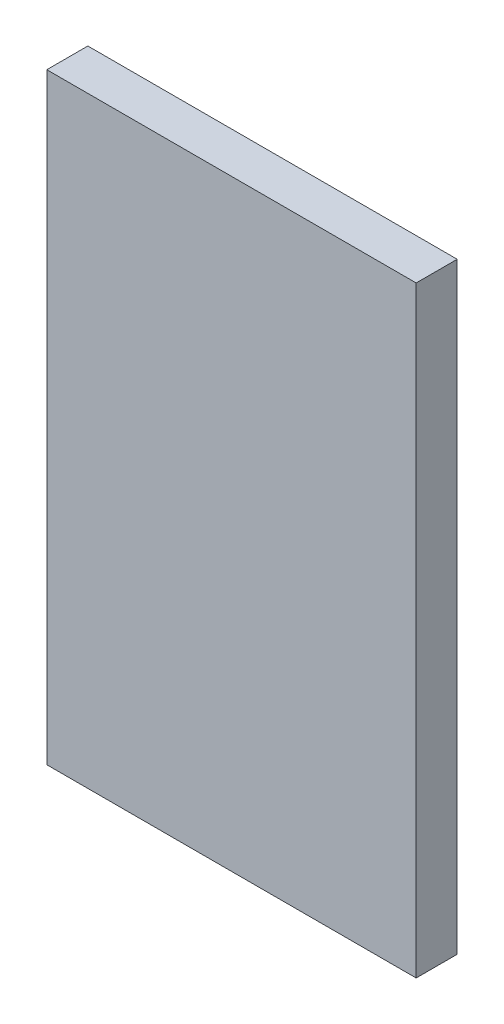
ISO-10303-21;
HEADER;
FILE_DESCRIPTION(('STEP AP214'),'2;1');
FILE_NAME('part.step','',(''),(''),'','','');
FILE_SCHEMA(('AUTOMOTIVE_DESIGN { 1 0 10303 214 1 1 1 1 }'));
ENDSEC;
DATA;
#1=APPLICATION_CONTEXT('core data for automotive mechanical design processes');
#2=APPLICATION_PROTOCOL_DEFINITION('international standard','automotive_design',2000,#1);
#3=PRODUCT_CONTEXT('',#1,'mechanical');
#4=PRODUCT('Part','Part','',(#3));
#5=PRODUCT_RELATED_PRODUCT_CATEGORY('part','',(#4));
#6=PRODUCT_DEFINITION_FORMATION('','',#4);
#7=PRODUCT_DEFINITION_CONTEXT('part definition',#1,'design');
#8=PRODUCT_DEFINITION('design','',#6,#7);
#9=PRODUCT_DEFINITION_SHAPE('','',#8);
#10=(LENGTH_UNIT() NAMED_UNIT(*) SI_UNIT(.MILLI.,.METRE.));
#11=(NAMED_UNIT(*) PLANE_ANGLE_UNIT() SI_UNIT($,.RADIAN.));
#12=(NAMED_UNIT(*) SI_UNIT($,.STERADIAN.) SOLID_ANGLE_UNIT());
#13=UNCERTAINTY_MEASURE_WITH_UNIT(LENGTH_MEASURE(1.E-05),#10,'distance_accuracy_value','');
#14=(GEOMETRIC_REPRESENTATION_CONTEXT(3) GLOBAL_UNCERTAINTY_ASSIGNED_CONTEXT((#13)) GLOBAL_UNIT_ASSIGNED_CONTEXT((#10,
#11,#12)) REPRESENTATION_CONTEXT('',''));
#15=CARTESIAN_POINT('',(0.,0.,0.));
#16=DIRECTION('',(0.,0.,1.));
#17=DIRECTION('',(1.,0.,0.));
#18=AXIS2_PLACEMENT_3D('',#15,#16,#17);
#19=CARTESIAN_POINT('',(0.,0.,6.));
#20=DIRECTION('',(1.,0.,0.));
#21=DIRECTION('',(0.,0.,-1.));
#22=AXIS2_PLACEMENT_3D('',#19,#20,#21);
#23=PLANE('',#22);
#24=DIRECTION('',(0.,-1.,0.));
#25=VECTOR('',#24,1.);
#26=CARTESIAN_POINT('',(0.,0.,0.));
#27=LINE('',#26,#25);
#28=CARTESIAN_POINT('',(0.,88.,0.));
#29=VERTEX_POINT('',#28);
#30=CARTESIAN_POINT('',(0.,0.,0.));
#31=VERTEX_POINT('',#30);
#32=EDGE_CURVE('E70',#29,#31,#27,.T.);
#33=ORIENTED_EDGE('',*,*,#32,.T.);
#34=DIRECTION('',(0.,0.,-1.));
#35=VECTOR('',#34,1.);
#36=CARTESIAN_POINT('',(0.,0.,6.));
#37=LINE('',#36,#35);
#38=CARTESIAN_POINT('',(0.,0.,6.));
#39=VERTEX_POINT('',#38);
#40=EDGE_CURVE('E11',#39,#31,#37,.T.);
#41=ORIENTED_EDGE('',*,*,#40,.F.);
#42=DIRECTION('',(0.,-1.,0.));
#43=VECTOR('',#42,1.);
#44=CARTESIAN_POINT('',(0.,0.,6.));
#45=LINE('',#44,#43);
#46=CARTESIAN_POINT('',(0.,88.,6.));
#47=VERTEX_POINT('',#46);
#48=EDGE_CURVE('E88',#47,#39,#45,.T.);
#49=ORIENTED_EDGE('',*,*,#48,.F.);
#50=DIRECTION('',(0.,0.,-1.));
#51=VECTOR('',#50,1.);
#52=CARTESIAN_POINT('',(0.,88.,6.));
#53=LINE('',#52,#51);
#54=EDGE_CURVE('E82',#47,#29,#53,.T.);
#55=ORIENTED_EDGE('',*,*,#54,.T.);
#56=EDGE_LOOP('',(#33,#41,#49,#55));
#57=FACE_BOUND('',#56,.T.);
#58=ADVANCED_FACE('F26',(#57),#23,.F.);
#59=CARTESIAN_POINT('',(0.,0.,6.));
#60=DIRECTION('',(0.,1.,0.));
#61=DIRECTION('',(0.,0.,1.));
#62=AXIS2_PLACEMENT_3D('',#59,#60,#61);
#63=PLANE('',#62);
#64=DIRECTION('',(1.,0.,0.));
#65=VECTOR('',#64,1.);
#66=CARTESIAN_POINT('',(0.,0.,0.));
#67=LINE('',#66,#65);
#68=CARTESIAN_POINT('',(54.,0.,0.));
#69=VERTEX_POINT('',#68);
#70=EDGE_CURVE('E66',#31,#69,#67,.T.);
#71=ORIENTED_EDGE('',*,*,#70,.T.);
#72=DIRECTION('',(0.,0.,-1.));
#73=VECTOR('',#72,1.);
#74=CARTESIAN_POINT('',(54.,0.,6.));
#75=LINE('',#74,#73);
#76=CARTESIAN_POINT('',(54.,0.,6.));
#77=VERTEX_POINT('',#76);
#78=EDGE_CURVE('E33',#77,#69,#75,.T.);
#79=ORIENTED_EDGE('',*,*,#78,.F.);
#80=DIRECTION('',(1.,0.,0.));
#81=VECTOR('',#80,1.);
#82=CARTESIAN_POINT('',(0.,0.,6.));
#83=LINE('',#82,#81);
#84=EDGE_CURVE('E78',#39,#77,#83,.T.);
#85=ORIENTED_EDGE('',*,*,#84,.F.);
#86=ORIENTED_EDGE('',*,*,#40,.T.);
#87=EDGE_LOOP('',(#71,#79,#85,#86));
#88=FACE_BOUND('',#87,.T.);
#89=ADVANCED_FACE('F77',(#88),#63,.F.);
#90=CARTESIAN_POINT('',(54.,0.,6.));
#91=DIRECTION('',(-1.,0.,0.));
#92=DIRECTION('',(0.,0.,1.));
#93=AXIS2_PLACEMENT_3D('',#90,#91,#92);
#94=PLANE('',#93);
#95=DIRECTION('',(0.,1.,0.));
#96=VECTOR('',#95,1.);
#97=CARTESIAN_POINT('',(54.,0.,0.));
#98=LINE('',#97,#96);
#99=CARTESIAN_POINT('',(54.,88.,0.));
#100=VERTEX_POINT('',#99);
#101=EDGE_CURVE('E71',#69,#100,#98,.T.);
#102=ORIENTED_EDGE('',*,*,#101,.T.);
#103=DIRECTION('',(0.,0.,-1.));
#104=VECTOR('',#103,1.);
#105=CARTESIAN_POINT('',(54.,88.,6.));
#106=LINE('',#105,#104);
#107=CARTESIAN_POINT('',(54.,88.,6.));
#108=VERTEX_POINT('',#107);
#109=EDGE_CURVE('E94',#108,#100,#106,.T.);
#110=ORIENTED_EDGE('',*,*,#109,.F.);
#111=DIRECTION('',(0.,1.,0.));
#112=VECTOR('',#111,1.);
#113=CARTESIAN_POINT('',(54.,0.,6.));
#114=LINE('',#113,#112);
#115=EDGE_CURVE('E45',#77,#108,#114,.T.);
#116=ORIENTED_EDGE('',*,*,#115,.F.);
#117=ORIENTED_EDGE('',*,*,#78,.T.);
#118=EDGE_LOOP('',(#102,#110,#116,#117));
#119=FACE_BOUND('',#118,.T.);
#120=ADVANCED_FACE('F97',(#119),#94,.F.);
#121=CARTESIAN_POINT('',(0.,88.,6.));
#122=DIRECTION('',(0.,-1.,0.));
#123=DIRECTION('',(0.,0.,-1.));
#124=AXIS2_PLACEMENT_3D('',#121,#122,#123);
#125=PLANE('',#124);
#126=DIRECTION('',(-1.,0.,0.));
#127=VECTOR('',#126,1.);
#128=CARTESIAN_POINT('',(0.,88.,0.));
#129=LINE('',#128,#127);
#130=EDGE_CURVE('E86',#100,#29,#129,.T.);
#131=ORIENTED_EDGE('',*,*,#130,.T.);
#132=ORIENTED_EDGE('',*,*,#54,.F.);
#133=DIRECTION('',(-1.,0.,0.));
#134=VECTOR('',#133,1.);
#135=CARTESIAN_POINT('',(0.,88.,6.));
#136=LINE('',#135,#134);
#137=EDGE_CURVE('E40',#108,#47,#136,.T.);
#138=ORIENTED_EDGE('',*,*,#137,.F.);
#139=ORIENTED_EDGE('',*,*,#109,.T.);
#140=EDGE_LOOP('',(#131,#132,#138,#139));
#141=FACE_BOUND('',#140,.T.);
#142=ADVANCED_FACE('F99',(#141),#125,.F.);
#143=CARTESIAN_POINT('',(0.,88.,6.));
#144=DIRECTION('',(0.,0.,-1.));
#145=DIRECTION('',(-1.,0.,0.));
#146=AXIS2_PLACEMENT_3D('',#143,#144,#145);
#147=PLANE('',#146);
#148=ORIENTED_EDGE('',*,*,#48,.T.);
#149=ORIENTED_EDGE('',*,*,#84,.T.);
#150=ORIENTED_EDGE('',*,*,#115,.T.);
#151=ORIENTED_EDGE('',*,*,#137,.T.);
#152=EDGE_LOOP('',(#148,#149,#150,#151));
#153=FACE_BOUND('',#152,.T.);
#154=ADVANCED_FACE('F100',(#153),#147,.F.);
#155=CARTESIAN_POINT('',(0.,88.,0.));
#156=DIRECTION('',(0.,0.,-1.));
#157=DIRECTION('',(-1.,0.,0.));
#158=AXIS2_PLACEMENT_3D('',#155,#156,#157);
#159=PLANE('',#158);
#160=ORIENTED_EDGE('',*,*,#32,.F.);
#161=ORIENTED_EDGE('',*,*,#130,.F.);
#162=ORIENTED_EDGE('',*,*,#101,.F.);
#163=ORIENTED_EDGE('',*,*,#70,.F.);
#164=EDGE_LOOP('',(#160,#161,#162,#163));
#165=FACE_BOUND('',#164,.T.);
#166=ADVANCED_FACE('F67',(#165),#159,.T.);
#167=CLOSED_SHELL('',(#58,#89,#120,#142,#154,#166));
#168=MANIFOLD_SOLID_BREP('B2',#167);
#169=ADVANCED_BREP_SHAPE_REPRESENTATION('',(#18,#168),#14);
#170=SHAPE_DEFINITION_REPRESENTATION(#9,#169);
ENDSEC;
END-ISO-10303-21;
